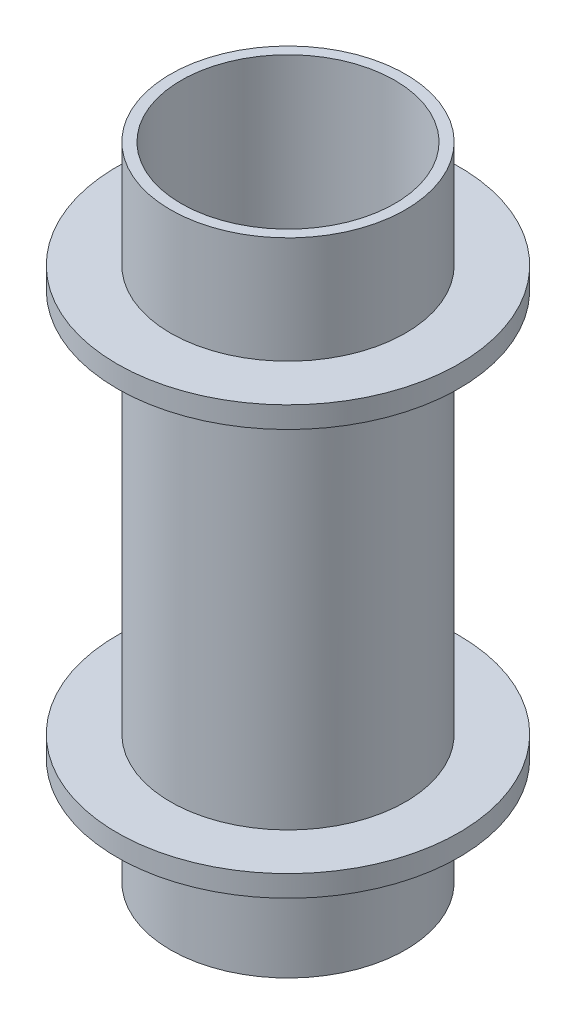
ISO-10303-21;
HEADER;
FILE_DESCRIPTION(('STEP AP214'),'2;1');
FILE_NAME('part.step','',(''),(''),'','','');
FILE_SCHEMA(('AUTOMOTIVE_DESIGN { 1 0 10303 214 1 1 1 1 }'));
ENDSEC;
DATA;
#1=APPLICATION_CONTEXT('core data for automotive mechanical design processes');
#2=APPLICATION_PROTOCOL_DEFINITION('international standard','automotive_design',2000,#1);
#3=PRODUCT_CONTEXT('',#1,'mechanical');
#4=PRODUCT('Part','Part','',(#3));
#5=PRODUCT_RELATED_PRODUCT_CATEGORY('part','',(#4));
#6=PRODUCT_DEFINITION_FORMATION('','',#4);
#7=PRODUCT_DEFINITION_CONTEXT('part definition',#1,'design');
#8=PRODUCT_DEFINITION('design','',#6,#7);
#9=PRODUCT_DEFINITION_SHAPE('','',#8);
#10=(LENGTH_UNIT() NAMED_UNIT(*) SI_UNIT(.MILLI.,.METRE.));
#11=(NAMED_UNIT(*) PLANE_ANGLE_UNIT() SI_UNIT($,.RADIAN.));
#12=(NAMED_UNIT(*) SI_UNIT($,.STERADIAN.) SOLID_ANGLE_UNIT());
#13=UNCERTAINTY_MEASURE_WITH_UNIT(LENGTH_MEASURE(1.E-05),#10,'distance_accuracy_value','');
#14=(GEOMETRIC_REPRESENTATION_CONTEXT(3) GLOBAL_UNCERTAINTY_ASSIGNED_CONTEXT((#13)) GLOBAL_UNIT_ASSIGNED_CONTEXT((#10,
#11,#12)) REPRESENTATION_CONTEXT('',''));
#15=CARTESIAN_POINT('',(0.,0.,0.));
#16=DIRECTION('',(0.,0.,1.));
#17=DIRECTION('',(1.,0.,0.));
#18=AXIS2_PLACEMENT_3D('',#15,#16,#17);
#19=CARTESIAN_POINT('',(0.,60.,0.));
#20=DIRECTION('',(0.,-1.,0.));
#21=DIRECTION('',(0.,0.,-1.));
#22=AXIS2_PLACEMENT_3D('',#19,#20,#21);
#23=CYLINDRICAL_SURFACE('',#22,11.);
#24=CARTESIAN_POINT('',(0.,48.,0.));
#25=DIRECTION('',(0.,1.,0.));
#26=DIRECTION('',(0.,0.,1.));
#27=AXIS2_PLACEMENT_3D('',#24,#25,#26);
#28=CIRCLE('',#27,11.);
#29=CARTESIAN_POINT('',(0.,48.,11.));
#30=VERTEX_POINT('',#29);
#31=EDGE_CURVE('E40',#30,#30,#28,.T.);
#32=ORIENTED_EDGE('',*,*,#31,.F.);
#33=EDGE_LOOP('',(#32));
#34=FACE_BOUND('',#33,.T.);
#35=CARTESIAN_POINT('',(0.,12.,0.));
#36=DIRECTION('',(0.,-1.,0.));
#37=DIRECTION('',(0.,0.,-1.));
#38=AXIS2_PLACEMENT_3D('',#35,#36,#37);
#39=CIRCLE('',#38,11.);
#40=CARTESIAN_POINT('',(0.,12.,-11.));
#41=VERTEX_POINT('',#40);
#42=EDGE_CURVE('E10',#41,#41,#39,.T.);
#43=ORIENTED_EDGE('',*,*,#42,.F.);
#44=EDGE_LOOP('',(#43));
#45=FACE_BOUND('',#44,.T.);
#46=ADVANCED_FACE('F33',(#34,#45),#23,.T.);
#47=CARTESIAN_POINT('',(0.,10.,0.));
#48=DIRECTION('',(0.,-1.,0.));
#49=DIRECTION('',(0.,0.,-1.));
#50=AXIS2_PLACEMENT_3D('',#47,#48,#49);
#51=CIRCLE('',#50,11.);
#52=CARTESIAN_POINT('',(0.,10.,-11.));
#53=VERTEX_POINT('',#52);
#54=EDGE_CURVE('E72',#53,#53,#51,.T.);
#55=ORIENTED_EDGE('',*,*,#54,.T.);
#56=EDGE_LOOP('',(#55));
#57=FACE_BOUND('',#56,.T.);
#58=CARTESIAN_POINT('',(0.,0.,0.));
#59=DIRECTION('',(0.,1.,0.));
#60=DIRECTION('',(0.,0.,1.));
#61=AXIS2_PLACEMENT_3D('',#58,#59,#60);
#62=CIRCLE('',#61,11.);
#63=CARTESIAN_POINT('',(0.,0.,11.));
#64=VERTEX_POINT('',#63);
#65=EDGE_CURVE('E48',#64,#64,#62,.T.);
#66=ORIENTED_EDGE('',*,*,#65,.T.);
#67=EDGE_LOOP('',(#66));
#68=FACE_BOUND('',#67,.T.);
#69=ADVANCED_FACE('F78',(#57,#68),#23,.T.);
#70=CARTESIAN_POINT('',(0.,60.,0.));
#71=DIRECTION('',(0.,1.,0.));
#72=DIRECTION('',(0.,0.,1.));
#73=AXIS2_PLACEMENT_3D('',#70,#71,#72);
#74=PLANE('',#73);
#75=CARTESIAN_POINT('',(0.,60.,0.));
#76=DIRECTION('',(0.,1.,0.));
#77=DIRECTION('',(0.,0.,1.));
#78=AXIS2_PLACEMENT_3D('',#75,#76,#77);
#79=CIRCLE('',#78,11.);
#80=CARTESIAN_POINT('',(0.,60.,11.));
#81=VERTEX_POINT('',#80);
#82=EDGE_CURVE('E44',#81,#81,#79,.T.);
#83=ORIENTED_EDGE('',*,*,#82,.T.);
#84=EDGE_LOOP('',(#83));
#85=FACE_BOUND('',#84,.T.);
#86=CARTESIAN_POINT('',(0.,60.,0.));
#87=DIRECTION('',(0.,1.,0.));
#88=DIRECTION('',(0.,0.,1.));
#89=AXIS2_PLACEMENT_3D('',#86,#87,#88);
#90=CIRCLE('',#89,10.);
#91=CARTESIAN_POINT('',(0.,60.,10.));
#92=VERTEX_POINT('',#91);
#93=EDGE_CURVE('E52',#92,#92,#90,.T.);
#94=ORIENTED_EDGE('',*,*,#93,.F.);
#95=EDGE_LOOP('',(#94));
#96=FACE_BOUND('',#95,.T.);
#97=ADVANCED_FACE('F107',(#85,#96),#74,.T.);
#98=CARTESIAN_POINT('',(0.,0.,0.));
#99=DIRECTION('',(0.,1.,0.));
#100=DIRECTION('',(0.,0.,1.));
#101=AXIS2_PLACEMENT_3D('',#98,#99,#100);
#102=PLANE('',#101);
#103=ORIENTED_EDGE('',*,*,#65,.F.);
#104=EDGE_LOOP('',(#103));
#105=FACE_BOUND('',#104,.T.);
#106=CARTESIAN_POINT('',(0.,0.,0.));
#107=DIRECTION('',(0.,1.,0.));
#108=DIRECTION('',(0.,0.,1.));
#109=AXIS2_PLACEMENT_3D('',#106,#107,#108);
#110=CIRCLE('',#109,10.);
#111=CARTESIAN_POINT('',(0.,0.,10.));
#112=VERTEX_POINT('',#111);
#113=EDGE_CURVE('E54',#112,#112,#110,.T.);
#114=ORIENTED_EDGE('',*,*,#113,.T.);
#115=EDGE_LOOP('',(#114));
#116=FACE_BOUND('',#115,.T.);
#117=ADVANCED_FACE('F111',(#105,#116),#102,.F.);
#118=CARTESIAN_POINT('',(0.,50.,0.));
#119=DIRECTION('',(0.,1.,0.));
#120=DIRECTION('',(0.,0.,1.));
#121=AXIS2_PLACEMENT_3D('',#118,#119,#120);
#122=CIRCLE('',#121,11.);
#123=CARTESIAN_POINT('',(0.,50.,11.));
#124=VERTEX_POINT('',#123);
#125=EDGE_CURVE('E63',#124,#124,#122,.T.);
#126=ORIENTED_EDGE('',*,*,#125,.T.);
#127=EDGE_LOOP('',(#126));
#128=FACE_BOUND('',#127,.T.);
#129=ORIENTED_EDGE('',*,*,#82,.F.);
#130=EDGE_LOOP('',(#129));
#131=FACE_BOUND('',#130,.T.);
#132=ADVANCED_FACE('F35',(#128,#131),#23,.T.);
#133=CARTESIAN_POINT('',(0.,60.,0.));
#134=DIRECTION('',(0.,-1.,0.));
#135=DIRECTION('',(0.,0.,-1.));
#136=AXIS2_PLACEMENT_3D('',#133,#134,#135);
#137=CYLINDRICAL_SURFACE('',#136,10.);
#138=ORIENTED_EDGE('',*,*,#93,.T.);
#139=EDGE_LOOP('',(#138));
#140=FACE_BOUND('',#139,.T.);
#141=ORIENTED_EDGE('',*,*,#113,.F.);
#142=EDGE_LOOP('',(#141));
#143=FACE_BOUND('',#142,.T.);
#144=ADVANCED_FACE('F110',(#140,#143),#137,.F.);
#145=CARTESIAN_POINT('',(0.,48.,0.));
#146=DIRECTION('',(0.,1.,0.));
#147=DIRECTION('',(0.,0.,1.));
#148=AXIS2_PLACEMENT_3D('',#145,#146,#147);
#149=CYLINDRICAL_SURFACE('',#148,16.);
#150=CARTESIAN_POINT('',(0.,48.,0.));
#151=DIRECTION('',(0.,1.,0.));
#152=DIRECTION('',(0.,0.,1.));
#153=AXIS2_PLACEMENT_3D('',#150,#151,#152);
#154=CIRCLE('',#153,16.);
#155=CARTESIAN_POINT('',(0.,48.,16.));
#156=VERTEX_POINT('',#155);
#157=EDGE_CURVE('E57',#156,#156,#154,.T.);
#158=ORIENTED_EDGE('',*,*,#157,.T.);
#159=EDGE_LOOP('',(#158));
#160=FACE_BOUND('',#159,.T.);
#161=CARTESIAN_POINT('',(0.,50.,0.));
#162=DIRECTION('',(0.,1.,0.));
#163=DIRECTION('',(0.,0.,1.));
#164=AXIS2_PLACEMENT_3D('',#161,#162,#163);
#165=CIRCLE('',#164,16.);
#166=CARTESIAN_POINT('',(0.,50.,16.));
#167=VERTEX_POINT('',#166);
#168=EDGE_CURVE('E60',#167,#167,#165,.T.);
#169=ORIENTED_EDGE('',*,*,#168,.F.);
#170=EDGE_LOOP('',(#169));
#171=FACE_BOUND('',#170,.T.);
#172=ADVANCED_FACE('F117',(#160,#171),#149,.T.);
#173=CARTESIAN_POINT('',(0.,48.,0.));
#174=DIRECTION('',(0.,1.,0.));
#175=DIRECTION('',(0.,0.,1.));
#176=AXIS2_PLACEMENT_3D('',#173,#174,#175);
#177=PLANE('',#176);
#178=ORIENTED_EDGE('',*,*,#31,.T.);
#179=EDGE_LOOP('',(#178));
#180=FACE_BOUND('',#179,.T.);
#181=ORIENTED_EDGE('',*,*,#157,.F.);
#182=EDGE_LOOP('',(#181));
#183=FACE_BOUND('',#182,.T.);
#184=ADVANCED_FACE('F98',(#180,#183),#177,.F.);
#185=CARTESIAN_POINT('',(0.,50.,0.));
#186=DIRECTION('',(0.,1.,0.));
#187=DIRECTION('',(0.,0.,1.));
#188=AXIS2_PLACEMENT_3D('',#185,#186,#187);
#189=PLANE('',#188);
#190=ORIENTED_EDGE('',*,*,#125,.F.);
#191=EDGE_LOOP('',(#190));
#192=FACE_BOUND('',#191,.T.);
#193=ORIENTED_EDGE('',*,*,#168,.T.);
#194=EDGE_LOOP('',(#193));
#195=FACE_BOUND('',#194,.T.);
#196=ADVANCED_FACE('F90',(#192,#195),#189,.T.);
#197=CARTESIAN_POINT('',(0.,12.,0.));
#198=DIRECTION('',(0.,-1.,0.));
#199=DIRECTION('',(0.,0.,-1.));
#200=AXIS2_PLACEMENT_3D('',#197,#198,#199);
#201=CYLINDRICAL_SURFACE('',#200,16.);
#202=CARTESIAN_POINT('',(0.,12.,0.));
#203=DIRECTION('',(0.,-1.,0.));
#204=DIRECTION('',(0.,0.,-1.));
#205=AXIS2_PLACEMENT_3D('',#202,#203,#204);
#206=CIRCLE('',#205,16.);
#207=CARTESIAN_POINT('',(0.,12.,-16.));
#208=VERTEX_POINT('',#207);
#209=EDGE_CURVE('E68',#208,#208,#206,.T.);
#210=ORIENTED_EDGE('',*,*,#209,.T.);
#211=EDGE_LOOP('',(#210));
#212=FACE_BOUND('',#211,.T.);
#213=CARTESIAN_POINT('',(0.,10.,0.));
#214=DIRECTION('',(0.,-1.,0.));
#215=DIRECTION('',(0.,0.,-1.));
#216=AXIS2_PLACEMENT_3D('',#213,#214,#215);
#217=CIRCLE('',#216,16.);
#218=CARTESIAN_POINT('',(0.,10.,-16.));
#219=VERTEX_POINT('',#218);
#220=EDGE_CURVE('E69',#219,#219,#217,.T.);
#221=ORIENTED_EDGE('',*,*,#220,.F.);
#222=EDGE_LOOP('',(#221));
#223=FACE_BOUND('',#222,.T.);
#224=ADVANCED_FACE('F88',(#212,#223),#201,.T.);
#225=CARTESIAN_POINT('',(0.,12.,0.));
#226=DIRECTION('',(0.,-1.,0.));
#227=DIRECTION('',(0.,0.,-1.));
#228=AXIS2_PLACEMENT_3D('',#225,#226,#227);
#229=PLANE('',#228);
#230=ORIENTED_EDGE('',*,*,#42,.T.);
#231=EDGE_LOOP('',(#230));
#232=FACE_BOUND('',#231,.T.);
#233=ORIENTED_EDGE('',*,*,#209,.F.);
#234=EDGE_LOOP('',(#233));
#235=FACE_BOUND('',#234,.T.);
#236=ADVANCED_FACE('F84',(#232,#235),#229,.F.);
#237=CARTESIAN_POINT('',(0.,10.,0.));
#238=DIRECTION('',(0.,-1.,0.));
#239=DIRECTION('',(0.,0.,-1.));
#240=AXIS2_PLACEMENT_3D('',#237,#238,#239);
#241=PLANE('',#240);
#242=ORIENTED_EDGE('',*,*,#54,.F.);
#243=EDGE_LOOP('',(#242));
#244=FACE_BOUND('',#243,.T.);
#245=ORIENTED_EDGE('',*,*,#220,.T.);
#246=EDGE_LOOP('',(#245));
#247=FACE_BOUND('',#246,.T.);
#248=ADVANCED_FACE('F81',(#244,#247),#241,.T.);
#249=CLOSED_SHELL('',(#46,#69,#97,#117,#132,#144,#172,#184,#196,#224,#236,#248));
#250=MANIFOLD_SOLID_BREP('B2',#249);
#251=ADVANCED_BREP_SHAPE_REPRESENTATION('',(#18,#250),#14);
#252=SHAPE_DEFINITION_REPRESENTATION(#9,#251);
ENDSEC;
END-ISO-10303-21;
